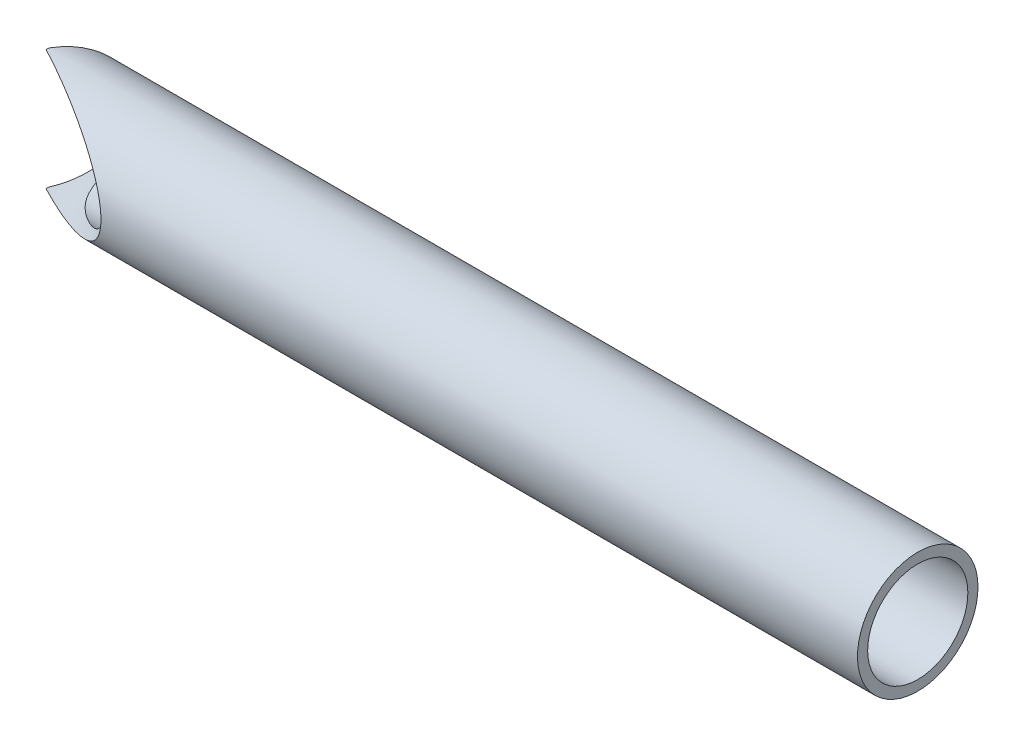
ISO-10303-21;
HEADER;
FILE_DESCRIPTION(('STEP AP214'),'2;1');
FILE_NAME('part.step','',(''),(''),'','','');
FILE_SCHEMA(('AUTOMOTIVE_DESIGN { 1 0 10303 214 1 1 1 1 }'));
ENDSEC;
DATA;
#1=APPLICATION_CONTEXT('core data for automotive mechanical design processes');
#2=APPLICATION_PROTOCOL_DEFINITION('international standard','automotive_design',2000,#1);
#3=PRODUCT_CONTEXT('',#1,'mechanical');
#4=PRODUCT('Part','Part','',(#3));
#5=PRODUCT_RELATED_PRODUCT_CATEGORY('part','',(#4));
#6=PRODUCT_DEFINITION_FORMATION('','',#4);
#7=PRODUCT_DEFINITION_CONTEXT('part definition',#1,'design');
#8=PRODUCT_DEFINITION('design','',#6,#7);
#9=PRODUCT_DEFINITION_SHAPE('','',#8);
#10=(LENGTH_UNIT() NAMED_UNIT(*) SI_UNIT(.MILLI.,.METRE.));
#11=(NAMED_UNIT(*) PLANE_ANGLE_UNIT() SI_UNIT($,.RADIAN.));
#12=(NAMED_UNIT(*) SI_UNIT($,.STERADIAN.) SOLID_ANGLE_UNIT());
#13=UNCERTAINTY_MEASURE_WITH_UNIT(LENGTH_MEASURE(1.E-05),#10,'distance_accuracy_value','');
#14=(GEOMETRIC_REPRESENTATION_CONTEXT(3) GLOBAL_UNCERTAINTY_ASSIGNED_CONTEXT((#13)) GLOBAL_UNIT_ASSIGNED_CONTEXT((#10,
#11,#12)) REPRESENTATION_CONTEXT('',''));
#15=CARTESIAN_POINT('',(0.,0.,0.));
#16=DIRECTION('',(0.,0.,1.));
#17=DIRECTION('',(1.,0.,0.));
#18=AXIS2_PLACEMENT_3D('',#15,#16,#17);
#19=CARTESIAN_POINT('',(304.8,0.,-1.11022302462516E-13));
#20=DIRECTION('',(1.,0.,0.));
#21=DIRECTION('',(0.,0.,-1.));
#22=AXIS2_PLACEMENT_3D('',#19,#20,#21);
#23=PLANE('',#22);
#24=CARTESIAN_POINT('',(304.8,0.,-1.11022302462516E-13));
#25=DIRECTION('',(1.,0.,0.));
#26=DIRECTION('',(0.,0.,-1.));
#27=AXIS2_PLACEMENT_3D('',#24,#25,#26);
#28=CIRCLE('',#27,21.082);
#29=CARTESIAN_POINT('',(304.8,0.,-21.0820000000001));
#30=VERTEX_POINT('',#29);
#31=EDGE_CURVE('E11',#30,#30,#28,.T.);
#32=ORIENTED_EDGE('',*,*,#31,.T.);
#33=EDGE_LOOP('',(#32));
#34=FACE_BOUND('',#33,.T.);
#35=CARTESIAN_POINT('',(304.8,0.,-1.11022302462516E-13));
#36=DIRECTION('',(1.,0.,0.));
#37=DIRECTION('',(0.,0.,-1.));
#38=AXIS2_PLACEMENT_3D('',#35,#36,#37);
#39=CIRCLE('',#38,17.526);
#40=CARTESIAN_POINT('',(304.8,0.,-17.5260000000001));
#41=VERTEX_POINT('',#40);
#42=EDGE_CURVE('E55',#41,#41,#39,.T.);
#43=ORIENTED_EDGE('',*,*,#42,.F.);
#44=EDGE_LOOP('',(#43));
#45=FACE_BOUND('',#44,.T.);
#46=ADVANCED_FACE('F43',(#34,#45),#23,.T.);
#47=CARTESIAN_POINT('',(304.8,0.,-1.11022302462516E-13));
#48=DIRECTION('',(-1.,0.,0.));
#49=DIRECTION('',(0.,0.,1.));
#50=AXIS2_PLACEMENT_3D('',#47,#48,#49);
#51=CYLINDRICAL_SURFACE('',#50,21.082);
#52=ORIENTED_EDGE('',*,*,#31,.F.);
#53=EDGE_LOOP('',(#52));
#54=FACE_BOUND('',#53,.T.);
#55=CARTESIAN_POINT('',(3.88578058618805E-13,0.,-1.11022302462516E-13));
#56=DIRECTION('',(1.,0.,0.));
#57=DIRECTION('',(0.,-0.999948117648207,0.0101863640131056));
#58=AXIS2_PLACEMENT_3D('',#55,#56,#57);
#59=CIRCLE('',#58,21.082);
#60=CARTESIAN_POINT('',(0.,-21.0809062162596,0.214748926124053));
#61=VERTEX_POINT('',#60);
#62=CARTESIAN_POINT('',(0.,-21.0671006615473,-0.792460545541385));
#63=VERTEX_POINT('',#62);
#64=EDGE_CURVE('E66',#61,#63,#59,.T.);
#65=ORIENTED_EDGE('',*,*,#64,.T.);
#66=CARTESIAN_POINT('',(-0.412528848871219,0.,-6.66133814775094E-13));
#67=DIRECTION('',(-0.887010833178221,0.,-0.461748613235035));
#68=DIRECTION('',(-0.461748613235035,0.,0.887010833178221));
#69=AXIS2_PLACEMENT_3D('',#66,#67,#68);
#70=ELLIPSE('',#69,23.7674662038362,21.082);
#71=CARTESIAN_POINT('',(0.,21.0671006615473,-0.792460545541385));
#72=VERTEX_POINT('',#71);
#73=EDGE_CURVE('E88',#63,#72,#70,.F.);
#74=ORIENTED_EDGE('',*,*,#73,.T.);
#75=CARTESIAN_POINT('',(3.88578058618805E-13,0.,-1.11022302462516E-13));
#76=DIRECTION('',(1.,0.,0.));
#77=DIRECTION('',(0.,0.999293267315585,-0.0375894386462891));
#78=AXIS2_PLACEMENT_3D('',#75,#76,#77);
#79=CIRCLE('',#78,21.082);
#80=CARTESIAN_POINT('',(0.,21.0809062162596,0.214748926124053));
#81=VERTEX_POINT('',#80);
#82=EDGE_CURVE('E74',#72,#81,#79,.T.);
#83=ORIENTED_EDGE('',*,*,#82,.T.);
#84=CARTESIAN_POINT('',(-0.412528848871219,0.,-6.66133814775094E-13));
#85=DIRECTION('',(-0.461748613235035,0.,0.887010833178221));
#86=DIRECTION('',(-0.887010833178221,0.,-0.461748613235035));
#87=AXIS2_PLACEMENT_3D('',#84,#85,#86);
#88=ELLIPSE('',#87,45.6568777809605,21.082);
#89=EDGE_CURVE('E82',#81,#61,#88,.F.);
#90=ORIENTED_EDGE('',*,*,#89,.T.);
#91=EDGE_LOOP('',(#65,#74,#83,#90));
#92=FACE_BOUND('',#91,.T.);
#93=ADVANCED_FACE('F45',(#54,#92),#51,.T.);
#94=CARTESIAN_POINT('',(304.8,0.,-1.11022302462516E-13));
#95=DIRECTION('',(-1.,0.,0.));
#96=DIRECTION('',(0.,0.,1.));
#97=AXIS2_PLACEMENT_3D('',#94,#95,#96);
#98=CYLINDRICAL_SURFACE('',#97,17.526);
#99=CARTESIAN_POINT('',(37.5956783460614,0.,17.5259999999997));
#100=CARTESIAN_POINT('',(37.5956757343342,-0.266591693921366,17.5259985254669));
#101=CARTESIAN_POINT('',(37.5852195806184,-0.533210368528521,17.5199024315982));
#102=CARTESIAN_POINT('',(37.5436769043272,-1.06428712664258,17.4956756124853));
#103=CARTESIAN_POINT('',(37.5125879680132,-1.32874495369672,17.4775434791977));
#104=CARTESIAN_POINT('',(37.4305715696158,-1.85371106065216,17.4296861124361));
#105=CARTESIAN_POINT('',(37.3796276924534,-2.11421588678214,17.3999512864077));
#106=CARTESIAN_POINT('',(37.2591517268877,-2.62940395903123,17.3295862109745));
#107=CARTESIAN_POINT('',(37.1896153738036,-2.88408585493862,17.2889534618334));
#108=CARTESIAN_POINT('',(37.0150763552254,-3.44546735012382,17.186879440517));
#109=CARTESIAN_POINT('',(36.9055779186927,-3.75029344773679,17.1227912894422));
#110=CARTESIAN_POINT('',(36.6636867105998,-4.34735917200366,16.981031459871));
#111=CARTESIAN_POINT('',(36.5312881321429,-4.63959558269722,16.9033563360054));
#112=CARTESIAN_POINT('',(36.1040445889777,-5.4968905859841,16.6523151825902));
#113=CARTESIAN_POINT('',(35.7793158505715,-6.0420357616058,16.4610289865015));
#114=CARTESIAN_POINT('',(35.1484677628083,-6.96670284677443,16.0878480383628));
#115=CARTESIAN_POINT('',(34.8532048965475,-7.35672085388379,15.91268416022));
#116=CARTESIAN_POINT('',(34.2350752115212,-8.10560937801357,15.5445733115743));
#117=CARTESIAN_POINT('',(33.9121916783198,-8.46446076631484,15.3516155676615));
#118=CARTESIAN_POINT('',(33.2447171596937,-9.15363558856362,14.9509484423164));
#119=CARTESIAN_POINT('',(32.9000894741168,-9.48390843229503,14.7432140410215));
#120=CARTESIAN_POINT('',(32.1942280749967,-10.1179099352186,14.3155440312093));
#121=CARTESIAN_POINT('',(31.8329883035228,-10.4216287919351,14.0956039655078));
#122=CARTESIAN_POINT('',(31.1256292114688,-10.982526906228,13.6623788783866));
#123=CARTESIAN_POINT('',(30.7804465328531,-11.2414888863027,13.4498579597254));
#124=CARTESIAN_POINT('',(30.0814528778671,-11.7401811112135,13.0168295574418));
#125=CARTESIAN_POINT('',(29.7276432542762,-11.9799143463133,12.796323323388));
#126=CARTESIAN_POINT('',(29.0128897012653,-12.4418004773528,12.3477127317297));
#127=CARTESIAN_POINT('',(28.6519396593035,-12.663937417077,12.1196017385253));
#128=CARTESIAN_POINT('',(27.9247645702659,-13.0916008440151,11.6563304804557));
#129=CARTESIAN_POINT('',(27.5585393416381,-13.2971267579232,11.4211699726703));
#130=CARTESIAN_POINT('',(26.821375562095,-13.6930015234821,10.9434377772123));
#131=CARTESIAN_POINT('',(26.4504284150518,-13.8833159942265,10.7008509244595));
#132=CARTESIAN_POINT('',(25.7058508428144,-14.2490951262902,10.2087198159034));
#133=CARTESIAN_POINT('',(25.3322204254746,-14.4245598310583,9.95917558045949));
#134=CARTESIAN_POINT('',(24.5836334089568,-14.7612126203226,9.45302136990812));
#135=CARTESIAN_POINT('',(24.2086775602099,-14.9224077488864,9.19641496392709));
#136=CARTESIAN_POINT('',(23.4584259946178,-15.2311010777694,8.67559134317339));
#137=CARTESIAN_POINT('',(23.083130287422,-15.3785996553676,8.41137433830159));
#138=CARTESIAN_POINT('',(22.4198497942577,-15.6277404739815,7.93654518426499));
#139=CARTESIAN_POINT('',(22.1316819550169,-15.7321153030365,7.72761706802599));
#140=CARTESIAN_POINT('',(21.5564880179457,-15.9329906700675,7.3044741940868));
#141=CARTESIAN_POINT('',(21.2694618979442,-16.029491361669,7.09025953963391));
#142=CARTESIAN_POINT('',(20.6971292390352,-16.2146350747561,6.65597683210696));
#143=CARTESIAN_POINT('',(20.4118233651604,-16.3032752188436,6.43590667360188));
#144=CARTESIAN_POINT('',(19.8438444104349,-16.4725425248561,5.98940922713016));
#145=CARTESIAN_POINT('',(19.5611711536262,-16.5531702258484,5.76298236815083));
#146=CARTESIAN_POINT('',(19.0001941144989,-16.7059747611284,5.30372351987854));
#147=CARTESIAN_POINT('',(18.7218799280404,-16.7781757475843,5.07091232223927));
#148=CARTESIAN_POINT('',(18.1698685960631,-16.9140531496684,4.59740790092257));
#149=CARTESIAN_POINT('',(17.8961716931655,-16.9777291185504,4.35671426499469));
#150=CARTESIAN_POINT('',(17.3549460163737,-17.0959968006572,3.86666131930177));
#151=CARTESIAN_POINT('',(17.0874132651965,-17.1505945213461,3.61730787325212));
#152=CARTESIAN_POINT('',(16.5600485107867,-17.2500269948893,3.10875660024493));
#153=CARTESIAN_POINT('',(16.3002151819178,-17.2948634369138,2.84956048567374));
#154=CARTESIAN_POINT('',(15.7866388580657,-17.3743736027317,2.31635879089339));
#155=CARTESIAN_POINT('',(15.5330356712516,-17.4088931841124,2.04219466678285));
#156=CARTESIAN_POINT('',(15.0385209099801,-17.4655588493314,1.4813404005012));
#157=CARTESIAN_POINT('',(14.7976093452937,-17.4877049236437,1.19465024868688));
#158=CARTESIAN_POINT('',(14.3320609894755,-17.5179015985779,0.608185347775268));
#159=CARTESIAN_POINT('',(14.107402267984,-17.5259715458154,0.308429139148951));
#160=CARTESIAN_POINT('',(13.6778075547061,-17.5260282825475,-0.304956753795662));
#161=CARTESIAN_POINT('',(13.4728676227163,-17.5180182921543,-0.61858364811869));
#162=CARTESIAN_POINT('',(13.1171103065544,-17.4863488686435,-1.20885680149257));
#163=CARTESIAN_POINT('',(12.9628494709119,-17.465347769395,-1.48356510155695));
#164=CARTESIAN_POINT('',(12.6735025828289,-17.4089497727558,-2.04149872177959));
#165=CARTESIAN_POINT('',(12.5384143994389,-17.3735544769048,-2.32472309116995));
#166=CARTESIAN_POINT('',(12.289374688493,-17.2872171159725,-2.89769174726171));
#167=CARTESIAN_POINT('',(12.175401352853,-17.2362912368986,-3.18742895643231));
#168=CARTESIAN_POINT('',(11.9694540243186,-17.1180108253338,-3.77135210278651));
#169=CARTESIAN_POINT('',(11.8774802782599,-17.0506561085281,-4.06553808984612));
#170=CARTESIAN_POINT('',(11.7155617426973,-16.8990863040413,-4.65556815442476));
#171=CARTESIAN_POINT('',(11.6456142051966,-16.8148733217489,-4.95141202041519));
#172=CARTESIAN_POINT('',(11.5267241499273,-16.6295723661745,-5.54200289702484));
#173=CARTESIAN_POINT('',(11.4777819747979,-16.5284841176609,-5.83674988967414));
#174=CARTESIAN_POINT('',(11.3990138978571,-16.3095816124055,-6.42310913947894));
#175=CARTESIAN_POINT('',(11.3692209470817,-16.1917389486219,-6.71471514877025));
#176=CARTESIAN_POINT('',(11.3265474260182,-15.9400030227592,-7.2922067801259));
#177=CARTESIAN_POINT('',(11.3136714016832,-15.8061054569163,-7.57809084426088));
#178=CARTESIAN_POINT('',(11.3002739925266,-15.4720489518085,-8.24381057772075));
#179=CARTESIAN_POINT('',(11.3058518113479,-15.2653651409013,-8.62050709693376));
#180=CARTESIAN_POINT('',(11.3374036085675,-14.8253087575275,-9.35709142082312));
#181=CARTESIAN_POINT('',(11.363384815199,-14.591926751827,-9.7169732207303));
#182=CARTESIAN_POINT('',(11.4302444398313,-14.0999191105803,-10.4180878718908));
#183=CARTESIAN_POINT('',(11.4711383313585,-13.8412674598608,-10.7593009278447));
#184=CARTESIAN_POINT('',(11.5630973693106,-13.30049965019,-11.4210323009506));
#185=CARTESIAN_POINT('',(11.6141616166598,-13.0183855666383,-11.7415524440748));
#186=CARTESIAN_POINT('',(11.723877305285,-12.4248415416481,-12.3683005242646));
#187=CARTESIAN_POINT('',(11.7826856550682,-12.1128576157135,-12.6739759695464));
#188=CARTESIAN_POINT('',(11.9033499851492,-11.4672898100729,-13.260930071901));
#189=CARTESIAN_POINT('',(11.9652059913159,-11.1337057470154,-13.5422085218338));
#190=CARTESIAN_POINT('',(12.089037382753,-10.4466238966316,-14.0790165868124));
#191=CARTESIAN_POINT('',(12.1510127216911,-10.0931327424196,-14.3345547004104));
#192=CARTESIAN_POINT('',(12.2726813712795,-9.36779500958398,-14.8187469142335));
#193=CARTESIAN_POINT('',(12.3323745249596,-8.99594717239198,-15.0473991674692));
#194=CARTESIAN_POINT('',(12.4554216496206,-8.18296116687626,-15.5063479163149));
#195=CARTESIAN_POINT('',(12.5181358309654,-7.7393637885716,-15.7324776236799));
#196=CARTESIAN_POINT('',(12.635481538374,-6.83360646084131,-16.1465318043693));
#197=CARTESIAN_POINT('',(12.6901123379519,-6.3714448477141,-16.3344528442956));
#198=CARTESIAN_POINT('',(12.7893120080732,-5.43172609184849,-16.670514354985));
#199=CARTESIAN_POINT('',(12.8338792630252,-4.95416649117594,-16.8186484391125));
#200=CARTESIAN_POINT('',(12.9114042341611,-3.98726114515002,-17.0737338292837));
#201=CARTESIAN_POINT('',(12.9443625827491,-3.49791604337294,-17.1806873786984));
#202=CARTESIAN_POINT('',(12.9967317603521,-2.52692426099745,-17.3496508360554));
#203=CARTESIAN_POINT('',(13.0165408009014,-2.04552910981843,-17.412984224909));
#204=CARTESIAN_POINT('',(13.0436537689205,-1.0787921600856,-17.4994966465916));
#205=CARTESIAN_POINT('',(13.0509578831511,-0.593450420582789,-17.5226762791164));
#206=CARTESIAN_POINT('',(13.0528400761785,0.377417221037651,-17.5286579845347));
#207=CARTESIAN_POINT('',(13.0474204439988,0.862943074321155,-17.5114673201131));
#208=CARTESIAN_POINT('',(13.0240232879626,1.83058574634327,-17.4368889572927));
#209=CARTESIAN_POINT('',(13.0060459512341,2.31270261577257,-17.3795018578792));
#210=CARTESIAN_POINT('',(12.9587974572564,3.25565691933255,-17.2273801641892));
#211=CARTESIAN_POINT('',(12.9298786834465,3.71670042411045,-17.1338090355951));
#212=CARTESIAN_POINT('',(12.8615824654994,4.62903445038871,-16.9101539153409));
#213=CARTESIAN_POINT('',(12.8222052772019,5.08032521017438,-16.7800708168533));
#214=CARTESIAN_POINT('',(12.7341823149961,5.97012105047333,-16.484480006277));
#215=CARTESIAN_POINT('',(12.6855381575885,6.40862834553443,-16.3189784718481));
#216=CARTESIAN_POINT('',(12.5805065901408,7.27020881934784,-15.9537982574262));
#217=CARTESIAN_POINT('',(12.5241189866222,7.69328161211793,-15.754118723428));
#218=CARTESIAN_POINT('',(12.4040980127461,8.53126141210142,-15.3168810898396));
#219=CARTESIAN_POINT('',(12.3403250107231,8.94573984374935,-15.0785400386636));
#220=CARTESIAN_POINT('',(12.209137465655,9.75344849428375,-14.5691084262682));
#221=CARTESIAN_POINT('',(12.1417228332117,10.1466781910625,-14.2980170608621));
#222=CARTESIAN_POINT('',(12.0061531026761,10.9102955982285,-13.7242340889998));
#223=CARTESIAN_POINT('',(11.9379969426669,11.2806434375339,-13.4214896683306));
#224=CARTESIAN_POINT('',(11.8047484196985,11.9956707208194,-12.7864462138049));
#225=CARTESIAN_POINT('',(11.7396560708181,12.340350046851,-12.4541470441576));
#226=CARTESIAN_POINT('',(11.6143922419065,13.0163651030946,-11.7466820830764));
#227=CARTESIAN_POINT('',(11.5545562400255,13.3464753324508,-11.3702827066671));
#228=CARTESIAN_POINT('',(11.449477726415,13.9742832041842,-10.589199458683));
#229=CARTESIAN_POINT('',(11.404238970734,14.2719724912267,-10.1845083398392));
#230=CARTESIAN_POINT('',(11.3363402982302,14.8314770762995,-9.35089361299598));
#231=CARTESIAN_POINT('',(11.3136135711169,15.0933965237695,-8.92204572455856));
#232=CARTESIAN_POINT('',(11.2998781075408,15.5795110126255,-8.04307874017645));
#233=CARTESIAN_POINT('',(11.3088436421262,15.8037365004987,-7.59297719153325));
#234=CARTESIAN_POINT('',(11.3575118380126,16.1361570592038,-6.84724835979179));
#235=CARTESIAN_POINT('',(11.3845941460805,16.2565598366814,-6.55618132229623));
#236=CARTESIAN_POINT('',(11.4577022989314,16.4808144307685,-5.97007231241614));
#237=CARTESIAN_POINT('',(11.5037240446164,16.584669822017,-5.67503121350218));
#238=CARTESIAN_POINT('',(11.6165416869377,16.7752836136702,-5.08397482880348));
#239=CARTESIAN_POINT('',(11.683300311057,16.8620722364624,-4.7879622262736));
#240=CARTESIAN_POINT('',(11.8387675203287,17.0187408063841,-4.19720396925863));
#241=CARTESIAN_POINT('',(11.9274764608599,17.0886204797189,-3.90245833536454));
#242=CARTESIAN_POINT('',(12.1270562745918,17.2118865987532,-3.31681574445057));
#243=CARTESIAN_POINT('',(12.2379428344996,17.2652613017055,-3.02592166788568));
#244=CARTESIAN_POINT('',(12.4809373622406,17.356263217038,-2.45064148916974));
#245=CARTESIAN_POINT('',(12.6130454533583,17.3938903379297,-2.16625542483728));
#246=CARTESIAN_POINT('',(12.8969238321857,17.4545951474949,-1.60545023699927));
#247=CARTESIAN_POINT('',(13.0487193832945,17.4776539145677,-1.32904191769746));
#248=CARTESIAN_POINT('',(13.3695753815121,17.51049773706,-0.78565617239405));
#249=CARTESIAN_POINT('',(13.5386381338951,17.5202810176256,-0.518680012062367));
#250=CARTESIAN_POINT('',(13.9929463125557,17.5301658092918,0.155881845784542));
#251=CARTESIAN_POINT('',(14.2891781242162,17.5214865346058,0.556214434911194));
#252=CARTESIAN_POINT('',(14.9094987408837,17.4795481063974,1.33330357089925));
#253=CARTESIAN_POINT('',(15.233606785757,17.4462718540506,1.71004351939387));
#254=CARTESIAN_POINT('',(15.903599957077,17.3587413655962,2.44372112066117));
#255=CARTESIAN_POINT('',(16.2495691656003,17.3044014145171,2.80057095840053));
#256=CARTESIAN_POINT('',(16.9563451504198,17.177499519199,3.4955557887758));
#257=CARTESIAN_POINT('',(17.3171493308719,17.1049407516622,3.83369403150589));
#258=CARTESIAN_POINT('',(18.074145922457,16.9379861627252,4.51629738235474));
#259=CARTESIAN_POINT('',(18.471083609647,16.8424473746218,4.85965034283082));
#260=CARTESIAN_POINT('',(19.2733884584434,16.6340643923991,5.53101200162108));
#261=CARTESIAN_POINT('',(19.6787575192409,16.5212162619974,5.85901718753105));
#262=CARTESIAN_POINT('',(20.4953711895783,16.2788518025198,6.50214129508176));
#263=CARTESIAN_POINT('',(20.9066213653711,16.1493186057658,6.81724674506366));
#264=CARTESIAN_POINT('',(21.7322759971374,15.8739601481862,7.43590455048023));
#265=CARTESIAN_POINT('',(22.1466802307201,15.7281360262871,7.73945771156844));
#266=CARTESIAN_POINT('',(22.9765558974475,15.4201779475868,8.33615240530492));
#267=CARTESIAN_POINT('',(23.3920266585968,15.2580525661829,8.62929930355604));
#268=CARTESIAN_POINT('',(24.2225720431433,14.9170369530587,9.20624600649722));
#269=CARTESIAN_POINT('',(24.6376466707264,14.7381469005152,9.49004591104191));
#270=CARTESIAN_POINT('',(25.4654583709686,14.3631035909842,10.0486317289701));
#271=CARTESIAN_POINT('',(25.8781971935922,14.1669658214909,10.3234254310751));
#272=CARTESIAN_POINT('',(26.7001561774995,13.7563529562482,10.864565800658));
#273=CARTESIAN_POINT('',(27.1093759848904,13.5418760394025,11.1309116256443));
#274=CARTESIAN_POINT('',(27.9786333983786,13.0624984133785,11.6912758648435));
#275=CARTESIAN_POINT('',(28.4378983488399,12.7947226386884,11.9840464662665));
#276=CARTESIAN_POINT('',(29.3466531513817,12.2318070410288,12.5580707245201));
#277=CARTESIAN_POINT('',(29.7961450903892,11.9366731323874,12.8393268517037));
#278=CARTESIAN_POINT('',(30.6815313196358,11.316588041932,13.3890651852282));
#279=CARTESIAN_POINT('',(31.1174374886919,10.991663946639,13.6575586650973));
#280=CARTESIAN_POINT('',(31.9714922286977,10.308622724273,14.1801943290088));
#281=CARTESIAN_POINT('',(32.3896459339594,9.95051529106554,14.4343406695945));
#282=CARTESIAN_POINT('',(33.0909724684634,9.30047282100156,14.8582760382518));
#283=CARTESIAN_POINT('',(33.3797668693346,9.01725019599009,15.0321162426082));
#284=CARTESIAN_POINT('',(33.9418468264398,8.42974785505879,15.369281143416));
#285=CARTESIAN_POINT('',(34.2151309368553,8.1254661819321,15.5326048597452));
#286=CARTESIAN_POINT('',(34.7420393485891,7.49474932244908,15.8465533830212));
#287=CARTESIAN_POINT('',(34.9956883870385,7.16834301570791,15.9971941901468));
#288=CARTESIAN_POINT('',(35.4787823312822,6.49211050864951,16.2833682797996));
#289=CARTESIAN_POINT('',(35.708238799297,6.14229562773736,16.4189087809032));
#290=CARTESIAN_POINT('',(36.2118785474258,5.29239287732205,16.7157850676371));
#291=CARTESIAN_POINT('',(36.4740047590975,4.78223969541902,16.8697821348234));
#292=CARTESIAN_POINT('',(36.8132645979151,3.98678280058907,17.0687141414746));
#293=CARTESIAN_POINT('',(36.9173256065307,3.71673072144591,17.1296591145103));
#294=CARTESIAN_POINT('',(37.1053606543379,3.16731859501964,17.2396959722182));
#295=CARTESIAN_POINT('',(37.1893398051233,2.88796093702899,17.2887908732128));
#296=CARTESIAN_POINT('',(37.3164844256438,2.39370757037564,17.3630772272715));
#297=CARTESIAN_POINT('',(37.3645974720794,2.18050655970892,17.3911721319426));
#298=CARTESIAN_POINT('',(37.4476947578886,1.75070959465793,17.4396797605552));
#299=CARTESIAN_POINT('',(37.4826811647896,1.53411420692665,17.4600937528035));
#300=CARTESIAN_POINT('',(37.5389211973868,1.09851929790022,17.4929024683177));
#301=CARTESIAN_POINT('',(37.5601737212688,0.879519585148737,17.5052965481784));
#302=CARTESIAN_POINT('',(37.5885517079343,0.440352524797704,17.5218449511073));
#303=CARTESIAN_POINT('',(37.5956805031592,0.220185464924857,17.5260012178572));
#304=CARTESIAN_POINT('',(37.5956783460614,0.,17.5259999999997));
#305=B_SPLINE_CURVE_WITH_KNOTS('',3,(#99,#100,#101,#102,#103,#104,#105,#106,#107,#108,#109,#110,
#111,#112,#113,#114,#115,#116,#117,#118,#119,#120,#121,#122,#123,#124,#125,#126,#127,#128,#129,
#130,#131,#132,#133,#134,#135,#136,#137,#138,#139,#140,#141,#142,#143,#144,#145,#146,#147,#148,
#149,#150,#151,#152,#153,#154,#155,#156,#157,#158,#159,#160,#161,#162,#163,#164,#165,#166,#167,
#168,#169,#170,#171,#172,#173,#174,#175,#176,#177,#178,#179,#180,#181,#182,#183,#184,#185,#186,
#187,#188,#189,#190,#191,#192,#193,#194,#195,#196,#197,#198,#199,#200,#201,#202,#203,#204,#205,
#206,#207,#208,#209,#210,#211,#212,#213,#214,#215,#216,#217,#218,#219,#220,#221,#222,#223,#224,
#225,#226,#227,#228,#229,#230,#231,#232,#233,#234,#235,#236,#237,#238,#239,#240,#241,#242,#243,
#244,#245,#246,#247,#248,#249,#250,#251,#252,#253,#254,#255,#256,#257,#258,#259,#260,#261,#262,
#263,#264,#265,#266,#267,#268,#269,#270,#271,#272,#273,#274,#275,#276,#277,#278,#279,#280,#281,
#282,#283,#284,#285,#286,#287,#288,#289,#290,#291,#292,#293,#294,#295,#296,#297,#298,#299,#300,
#301,#302,#303,#304),.UNSPECIFIED.,.T.,.F.,(4,2,2,2,2,2,2,2,2,2,2,2,2,2,2,2,2,2,2,2,2,2,2,2,2,2,
2,2,2,2,2,2,2,2,2,2,2,2,2,2,2,2,2,2,2,2,2,2,2,2,2,2,2,2,2,2,2,2,2,2,2,2,2,2,2,2,2,2,2,2,2,2,2,2,
2,2,2,2,2,2,2,2,2,2,2,2,2,2,2,2,2,2,2,2,2,2,2,2,2,2,2,2,4),(0.,0.79955087643319,
1.59919530530718,2.39950224768414,3.19999291954056,4.18898676247546,5.17823175788323,
7.15830390467635,8.71517370786121,10.2729923954271,11.8335146305073,13.3946105254252,
14.8370915704042,16.27934785837,17.7228973505047,19.1664966434211,20.6132715517281,
22.0600422267772,23.5060946848395,24.9521072987862,26.0647708277064,27.1774126432257,
28.290460080713,29.4034325829683,30.5131324530138,31.6228904531903,32.731911131023,
33.840739742174,34.9653903926484,36.0900419089549,37.2131464517328,38.3360261079532,
39.2823705484477,40.2286097247306,41.1738660793116,42.1191330391891,43.0642820204915,
44.0094464184648,44.9562328848505,45.9032737217397,47.1904956918303,48.4781738871519,
49.7671920076116,51.0560962273561,52.3770042109122,53.6979234083944,55.0184050454852,
56.3389773433335,57.8426297153766,59.34641714468,60.8504458191391,62.3543925478023,
63.8104179830223,65.2664216723379,66.7221634441883,68.1778835238315,69.5902392746402,
71.002560478767,72.4146355472543,73.8267459043939,75.2721935283352,76.7176766525803,
78.165611315058,79.61355263049,81.1242396507248,82.6353150796384,84.1418924422506,
85.6472469905686,86.5948053957449,87.54215882685,88.4878192403258,89.4334949651832,
90.379841967589,91.3261944679008,92.2737735920757,93.2214793894835,94.7131725728188,
96.2059036973172,97.7047740969608,99.2033833291222,100.803094118047,102.403169234783,
104.004874824258,105.606468505748,107.207224021926,108.807962431562,110.407277864421,
112.006752295815,113.826756567519,115.64636830112,117.464341669672,119.281785617041,
120.601832055383,121.922001342696,123.240479398147,124.558324436794,126.33287021968,
127.219285061168,128.10547403575,128.766057266423,129.426531370685,130.087058455553,
130.747429672934),.UNSPECIFIED.);
#306=CARTESIAN_POINT('',(37.5956783460614,0.,17.5259999999997));
#307=VERTEX_POINT('',#306);
#308=EDGE_CURVE('E86',#307,#307,#305,.T.);
#309=ORIENTED_EDGE('',*,*,#308,.F.);
#310=EDGE_LOOP('',(#309));
#311=FACE_BOUND('',#310,.T.);
#312=ORIENTED_EDGE('',*,*,#42,.T.);
#313=EDGE_LOOP('',(#312));
#314=FACE_BOUND('',#313,.T.);
#315=ADVANCED_FACE('F108',(#311,#314),#98,.F.);
#316=CARTESIAN_POINT('',(157.836598427826,0.,226.003175688896));
#317=DIRECTION('',(-0.573576436351044,0.,-0.819152044288993));
#318=DIRECTION('',(-0.819152044288993,0.,0.573576436351044));
#319=AXIS2_PLACEMENT_3D('',#316,#317,#318);
#320=CYLINDRICAL_SURFACE('',#319,21.082);
#321=ORIENTED_EDGE('',*,*,#308,.T.);
#322=EDGE_LOOP('',(#321));
#323=FACE_BOUND('',#322,.T.);
#324=ORIENTED_EDGE('',*,*,#64,.F.);
#325=ORIENTED_EDGE('',*,*,#89,.F.);
#326=ORIENTED_EDGE('',*,*,#82,.F.);
#327=ORIENTED_EDGE('',*,*,#73,.F.);
#328=EDGE_LOOP('',(#324,#325,#326,#327));
#329=FACE_BOUND('',#328,.T.);
#330=ADVANCED_FACE('F83',(#323,#329),#320,.F.);
#331=CLOSED_SHELL('',(#46,#93,#315,#330));
#332=MANIFOLD_SOLID_BREP('B2',#331);
#333=ADVANCED_BREP_SHAPE_REPRESENTATION('',(#18,#332),#14);
#334=SHAPE_DEFINITION_REPRESENTATION(#9,#333);
ENDSEC;
END-ISO-10303-21;
